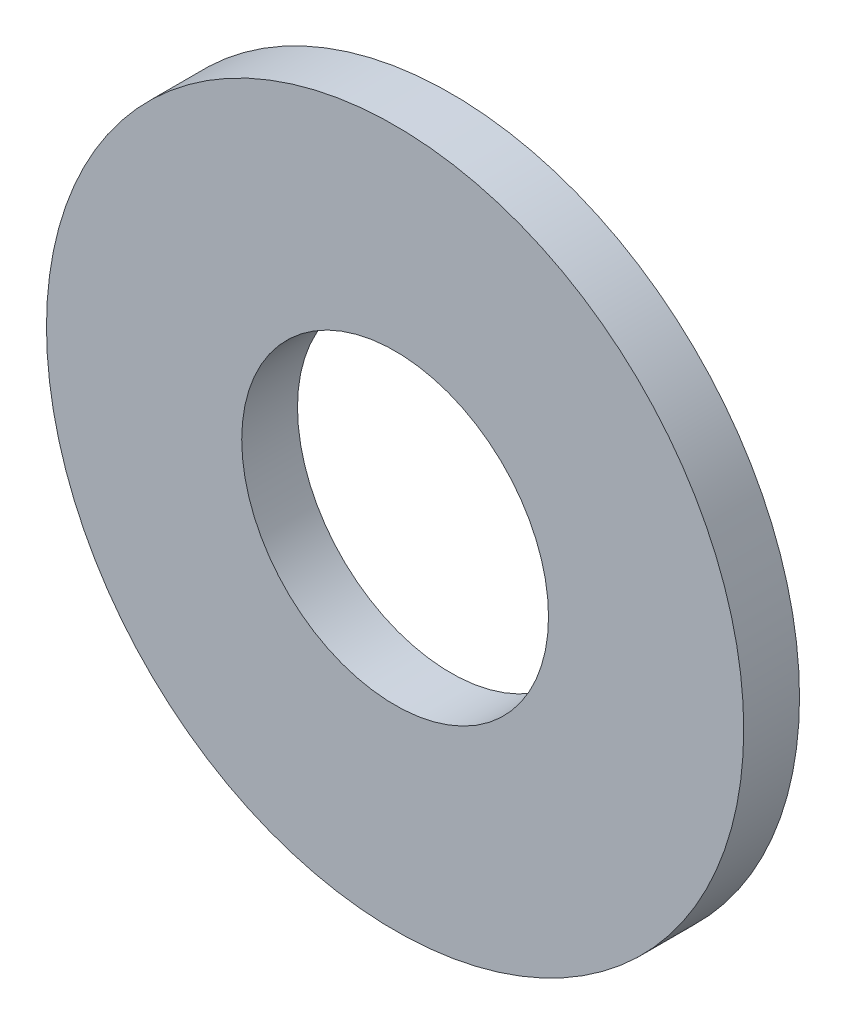
ISO-10303-21;
HEADER;
FILE_DESCRIPTION(('STEP AP214'),'2;1');
FILE_NAME('part.step','',(''),(''),'','','');
FILE_SCHEMA(('AUTOMOTIVE_DESIGN { 1 0 10303 214 1 1 1 1 }'));
ENDSEC;
DATA;
#1=APPLICATION_CONTEXT('core data for automotive mechanical design processes');
#2=APPLICATION_PROTOCOL_DEFINITION('international standard','automotive_design',2000,#1);
#3=PRODUCT_CONTEXT('',#1,'mechanical');
#4=PRODUCT('Part','Part','',(#3));
#5=PRODUCT_RELATED_PRODUCT_CATEGORY('part','',(#4));
#6=PRODUCT_DEFINITION_FORMATION('','',#4);
#7=PRODUCT_DEFINITION_CONTEXT('part definition',#1,'design');
#8=PRODUCT_DEFINITION('design','',#6,#7);
#9=PRODUCT_DEFINITION_SHAPE('','',#8);
#10=(LENGTH_UNIT() NAMED_UNIT(*) SI_UNIT(.MILLI.,.METRE.));
#11=(NAMED_UNIT(*) PLANE_ANGLE_UNIT() SI_UNIT($,.RADIAN.));
#12=(NAMED_UNIT(*) SI_UNIT($,.STERADIAN.) SOLID_ANGLE_UNIT());
#13=UNCERTAINTY_MEASURE_WITH_UNIT(LENGTH_MEASURE(1.E-05),#10,'distance_accuracy_value','');
#14=(GEOMETRIC_REPRESENTATION_CONTEXT(3) GLOBAL_UNCERTAINTY_ASSIGNED_CONTEXT((#13)) GLOBAL_UNIT_ASSIGNED_CONTEXT((#10,
#11,#12)) REPRESENTATION_CONTEXT('',''));
#15=CARTESIAN_POINT('',(0.,0.,0.));
#16=DIRECTION('',(0.,0.,1.));
#17=DIRECTION('',(1.,0.,0.));
#18=AXIS2_PLACEMENT_3D('',#15,#16,#17);
#19=CARTESIAN_POINT('',(0.,0.,0.));
#20=DIRECTION('',(0.,0.,1.));
#21=DIRECTION('',(1.,0.,0.));
#22=AXIS2_PLACEMENT_3D('',#19,#20,#21);
#23=PLANE('',#22);
#24=CARTESIAN_POINT('',(0.,0.,0.));
#25=DIRECTION('',(0.,0.,1.));
#26=DIRECTION('',(1.,0.,0.));
#27=AXIS2_PLACEMENT_3D('',#24,#25,#26);
#28=CIRCLE('',#27,1.1);
#29=CARTESIAN_POINT('',(1.1,0.,0.));
#30=VERTEX_POINT('',#29);
#31=EDGE_CURVE('E27',#30,#30,#28,.T.);
#32=ORIENTED_EDGE('',*,*,#31,.T.);
#33=EDGE_LOOP('',(#32));
#34=FACE_BOUND('',#33,.T.);
#35=CARTESIAN_POINT('',(0.,0.,0.));
#36=DIRECTION('',(0.,0.,1.));
#37=DIRECTION('',(1.,0.,0.));
#38=AXIS2_PLACEMENT_3D('',#35,#36,#37);
#39=CIRCLE('',#38,2.5);
#40=CARTESIAN_POINT('',(2.5,0.,0.));
#41=VERTEX_POINT('',#40);
#42=EDGE_CURVE('E18',#41,#41,#39,.T.);
#43=ORIENTED_EDGE('',*,*,#42,.F.);
#44=EDGE_LOOP('',(#43));
#45=FACE_BOUND('',#44,.T.);
#46=ADVANCED_FACE('F15',(#34,#45),#23,.F.);
#47=CARTESIAN_POINT('',(0.,0.,0.));
#48=DIRECTION('',(0.,0.,1.));
#49=DIRECTION('',(1.,0.,0.));
#50=AXIS2_PLACEMENT_3D('',#47,#48,#49);
#51=CYLINDRICAL_SURFACE('',#50,2.5);
#52=ORIENTED_EDGE('',*,*,#42,.T.);
#53=EDGE_LOOP('',(#52));
#54=FACE_BOUND('',#53,.T.);
#55=CARTESIAN_POINT('',(0.,0.,0.4));
#56=DIRECTION('',(0.,0.,1.));
#57=DIRECTION('',(1.,0.,0.));
#58=AXIS2_PLACEMENT_3D('',#55,#56,#57);
#59=CIRCLE('',#58,2.5);
#60=CARTESIAN_POINT('',(2.5,0.,0.4));
#61=VERTEX_POINT('',#60);
#62=EDGE_CURVE('E22',#61,#61,#59,.T.);
#63=ORIENTED_EDGE('',*,*,#62,.F.);
#64=EDGE_LOOP('',(#63));
#65=FACE_BOUND('',#64,.T.);
#66=ADVANCED_FACE('F35',(#54,#65),#51,.T.);
#67=CARTESIAN_POINT('',(0.,0.,0.));
#68=DIRECTION('',(0.,0.,1.));
#69=DIRECTION('',(1.,0.,0.));
#70=AXIS2_PLACEMENT_3D('',#67,#68,#69);
#71=CYLINDRICAL_SURFACE('',#70,1.1);
#72=ORIENTED_EDGE('',*,*,#31,.F.);
#73=EDGE_LOOP('',(#72));
#74=FACE_BOUND('',#73,.T.);
#75=CARTESIAN_POINT('',(0.,0.,0.4));
#76=DIRECTION('',(0.,0.,1.));
#77=DIRECTION('',(1.,0.,0.));
#78=AXIS2_PLACEMENT_3D('',#75,#76,#77);
#79=CIRCLE('',#78,1.1);
#80=CARTESIAN_POINT('',(1.1,0.,0.4));
#81=VERTEX_POINT('',#80);
#82=EDGE_CURVE('E10',#81,#81,#79,.F.);
#83=ORIENTED_EDGE('',*,*,#82,.F.);
#84=EDGE_LOOP('',(#83));
#85=FACE_BOUND('',#84,.T.);
#86=ADVANCED_FACE('F43',(#74,#85),#71,.F.);
#87=CARTESIAN_POINT('',(0.,0.,0.4));
#88=DIRECTION('',(0.,0.,1.));
#89=DIRECTION('',(1.,0.,0.));
#90=AXIS2_PLACEMENT_3D('',#87,#88,#89);
#91=PLANE('',#90);
#92=ORIENTED_EDGE('',*,*,#82,.T.);
#93=EDGE_LOOP('',(#92));
#94=FACE_BOUND('',#93,.T.);
#95=ORIENTED_EDGE('',*,*,#62,.T.);
#96=EDGE_LOOP('',(#95));
#97=FACE_BOUND('',#96,.T.);
#98=ADVANCED_FACE('F44',(#94,#97),#91,.T.);
#99=CLOSED_SHELL('',(#46,#66,#86,#98));
#100=MANIFOLD_SOLID_BREP('B1',#99);
#101=ADVANCED_BREP_SHAPE_REPRESENTATION('',(#18,#100),#14);
#102=SHAPE_DEFINITION_REPRESENTATION(#9,#101);
ENDSEC;
END-ISO-10303-21;
